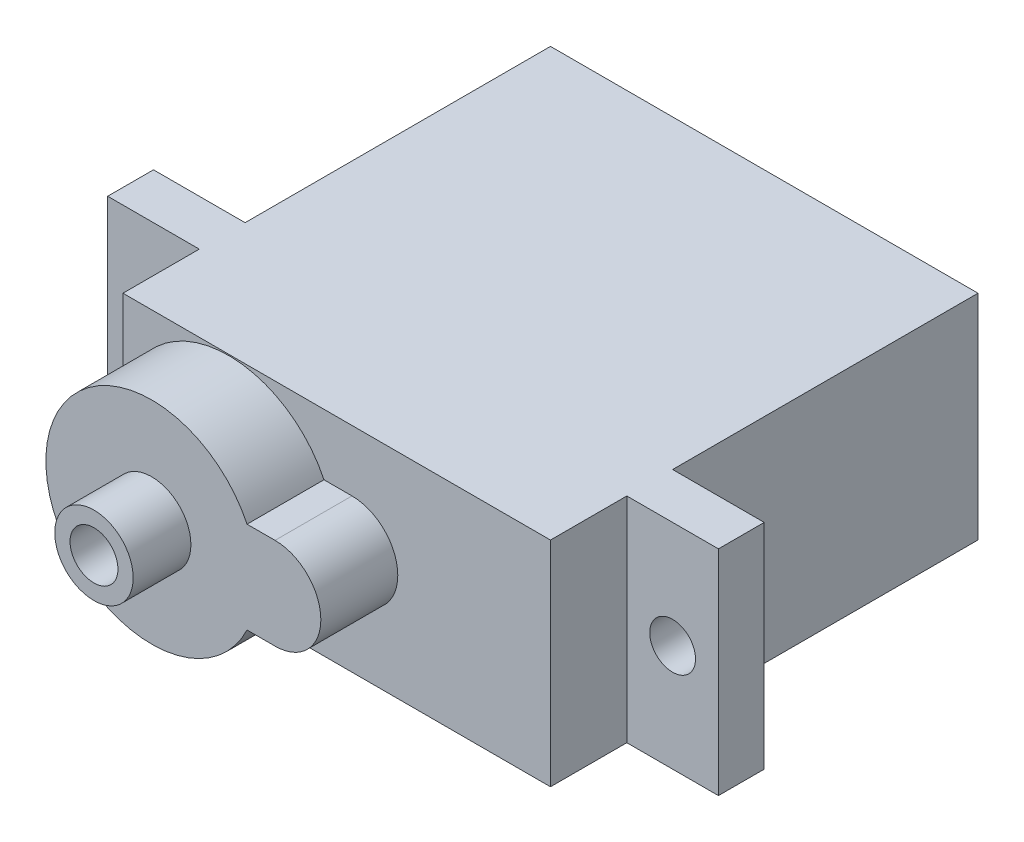
ISO-10303-21;
HEADER;
FILE_DESCRIPTION(('STEP AP214'),'2;1');
FILE_NAME('part.step','',(''),(''),'','','');
FILE_SCHEMA(('AUTOMOTIVE_DESIGN { 1 0 10303 214 1 1 1 1 }'));
ENDSEC;
DATA;
#1=APPLICATION_CONTEXT('core data for automotive mechanical design processes');
#2=APPLICATION_PROTOCOL_DEFINITION('international standard','automotive_design',2000,#1);
#3=PRODUCT_CONTEXT('',#1,'mechanical');
#4=PRODUCT('Part','Part','',(#3));
#5=PRODUCT_RELATED_PRODUCT_CATEGORY('part','',(#4));
#6=PRODUCT_DEFINITION_FORMATION('','',#4);
#7=PRODUCT_DEFINITION_CONTEXT('part definition',#1,'design');
#8=PRODUCT_DEFINITION('design','',#6,#7);
#9=PRODUCT_DEFINITION_SHAPE('','',#8);
#10=(LENGTH_UNIT() NAMED_UNIT(*) SI_UNIT(.MILLI.,.METRE.));
#11=(NAMED_UNIT(*) PLANE_ANGLE_UNIT() SI_UNIT($,.RADIAN.));
#12=(NAMED_UNIT(*) SI_UNIT($,.STERADIAN.) SOLID_ANGLE_UNIT());
#13=UNCERTAINTY_MEASURE_WITH_UNIT(LENGTH_MEASURE(1.E-05),#10,'distance_accuracy_value','');
#14=(GEOMETRIC_REPRESENTATION_CONTEXT(3) GLOBAL_UNCERTAINTY_ASSIGNED_CONTEXT((#13)) GLOBAL_UNIT_ASSIGNED_CONTEXT((#10,
#11,#12)) REPRESENTATION_CONTEXT('',''));
#15=CARTESIAN_POINT('',(0.,0.,0.));
#16=DIRECTION('',(0.,0.,1.));
#17=DIRECTION('',(1.,0.,0.));
#18=AXIS2_PLACEMENT_3D('',#15,#16,#17);
#19=CARTESIAN_POINT('',(0.,0.,26.225));
#20=DIRECTION('',(0.,0.,1.));
#21=DIRECTION('',(1.,0.,0.));
#22=AXIS2_PLACEMENT_3D('',#19,#20,#21);
#23=PLANE('',#22);
#24=DIRECTION('',(-1.,0.,0.));
#25=VECTOR('',#24,1.);
#26=CARTESIAN_POINT('',(0.,-2.38125656149906,26.225));
#27=LINE('',#26,#25);
#28=CARTESIAN_POINT('',(1.01053601839695,-2.38125656149906,26.225));
#29=VERTEX_POINT('',#28);
#30=CARTESIAN_POINT('',(-0.44419736512808,-2.38125656149906,26.225));
#31=VERTEX_POINT('',#30);
#32=EDGE_CURVE('E169',#29,#31,#27,.T.);
#33=ORIENTED_EDGE('',*,*,#32,.F.);
#34=CARTESIAN_POINT('',(1.01053601839692,3.67197356602013E-05,26.225));
#35=DIRECTION('',(0.,0.,1.));
#36=DIRECTION('',(1.,0.,0.));
#37=AXIS2_PLACEMENT_3D('',#34,#35,#36);
#38=CIRCLE('',#37,2.38129328074953);
#39=CARTESIAN_POINT('',(1.010604,2.38133,26.225));
#40=VERTEX_POINT('',#39);
#41=EDGE_CURVE('E176',#29,#40,#38,.T.);
#42=ORIENTED_EDGE('',*,*,#41,.T.);
#43=DIRECTION('',(-1.,0.,0.));
#44=VECTOR('',#43,1.);
#45=CARTESIAN_POINT('',(0.,2.38133,26.225));
#46=LINE('',#45,#44);
#47=CARTESIAN_POINT('',(-0.444232638800502,2.38133,26.225));
#48=VERTEX_POINT('',#47);
#49=EDGE_CURVE('E181',#40,#48,#46,.T.);
#50=ORIENTED_EDGE('',*,*,#49,.T.);
#51=CARTESIAN_POINT('',(-5.40198086063468,0.,26.225));
#52=DIRECTION('',(0.,0.,1.));
#53=DIRECTION('',(1.,0.,0.));
#54=AXIS2_PLACEMENT_3D('',#51,#52,#53);
#55=CIRCLE('',#54,5.5);
#56=CARTESIAN_POINT('',(-10.89565,0.263816957728569,26.225));
#57=VERTEX_POINT('',#56);
#58=EDGE_CURVE('E196',#48,#57,#55,.T.);
#59=ORIENTED_EDGE('',*,*,#58,.T.);
#60=DIRECTION('',(0.,-1.,0.));
#61=VECTOR('',#60,1.);
#62=CARTESIAN_POINT('',(-10.89565,0.,26.225));
#63=LINE('',#62,#61);
#64=CARTESIAN_POINT('',(-10.89565,-0.263816957728569,26.225));
#65=VERTEX_POINT('',#64);
#66=EDGE_CURVE('E198',#57,#65,#63,.T.);
#67=ORIENTED_EDGE('',*,*,#66,.T.);
#68=EDGE_CURVE('E185',#65,#31,#55,.T.);
#69=ORIENTED_EDGE('',*,*,#68,.T.);
#70=EDGE_LOOP('',(#33,#42,#50,#59,#67,#69));
#71=FACE_BOUND('',#70,.T.);
#72=CARTESIAN_POINT('',(-5.40198086063468,0.,26.225));
#73=DIRECTION('',(0.,0.,1.));
#74=DIRECTION('',(1.,0.,0.));
#75=AXIS2_PLACEMENT_3D('',#72,#73,#74);
#76=CIRCLE('',#75,2.0388374802303);
#77=CARTESIAN_POINT('',(-3.36314338040439,0.,26.225));
#78=VERTEX_POINT('',#77);
#79=EDGE_CURVE('E192',#78,#78,#76,.T.);
#80=ORIENTED_EDGE('',*,*,#79,.F.);
#81=EDGE_LOOP('',(#80));
#82=FACE_BOUND('',#81,.T.);
#83=ADVANCED_FACE('F40',(#71,#82),#23,.T.);
#84=CARTESIAN_POINT('',(11.32935,5.555,22.225));
#85=DIRECTION('',(0.,0.,-1.));
#86=DIRECTION('',(-1.,0.,0.));
#87=AXIS2_PLACEMENT_3D('',#84,#85,#86);
#88=PLANE('',#87);
#89=CARTESIAN_POINT('',(-5.40198086063468,0.,22.225));
#90=DIRECTION('',(0.,0.,1.));
#91=DIRECTION('',(1.,0.,0.));
#92=AXIS2_PLACEMENT_3D('',#89,#90,#91);
#93=CIRCLE('',#92,5.5);
#94=CARTESIAN_POINT('',(-10.89565,-0.263816957728569,22.225));
#95=VERTEX_POINT('',#94);
#96=CARTESIAN_POINT('',(-0.44419736512808,-2.38125656149906,22.225));
#97=VERTEX_POINT('',#96);
#98=EDGE_CURVE('E187',#95,#97,#93,.T.);
#99=ORIENTED_EDGE('',*,*,#98,.F.);
#100=DIRECTION('',(0.,-1.,0.));
#101=VECTOR('',#100,1.);
#102=CARTESIAN_POINT('',(-10.89565,5.555,22.225));
#103=LINE('',#102,#101);
#104=CARTESIAN_POINT('',(-10.89565,-5.555,22.225));
#105=VERTEX_POINT('',#104);
#106=EDGE_CURVE('E216',#95,#105,#103,.T.);
#107=ORIENTED_EDGE('',*,*,#106,.T.);
#108=DIRECTION('',(1.,0.,0.));
#109=VECTOR('',#108,1.);
#110=CARTESIAN_POINT('',(11.32935,-5.555,22.225));
#111=LINE('',#110,#109);
#112=CARTESIAN_POINT('',(11.32935,-5.555,22.225));
#113=VERTEX_POINT('',#112);
#114=EDGE_CURVE('E282',#105,#113,#111,.T.);
#115=ORIENTED_EDGE('',*,*,#114,.T.);
#116=DIRECTION('',(0.,-1.,0.));
#117=VECTOR('',#116,1.);
#118=CARTESIAN_POINT('',(11.32935,5.555,22.225));
#119=LINE('',#118,#117);
#120=CARTESIAN_POINT('',(11.32935,5.555,22.225));
#121=VERTEX_POINT('',#120);
#122=EDGE_CURVE('E239',#121,#113,#119,.T.);
#123=ORIENTED_EDGE('',*,*,#122,.F.);
#124=DIRECTION('',(1.,0.,0.));
#125=VECTOR('',#124,1.);
#126=CARTESIAN_POINT('',(11.32935,5.555,22.225));
#127=LINE('',#126,#125);
#128=CARTESIAN_POINT('',(-10.89565,5.555,22.225));
#129=VERTEX_POINT('',#128);
#130=EDGE_CURVE('E340',#129,#121,#127,.T.);
#131=ORIENTED_EDGE('',*,*,#130,.F.);
#132=CARTESIAN_POINT('',(-10.89565,0.263816957728569,22.225));
#133=VERTEX_POINT('',#132);
#134=EDGE_CURVE('E238',#129,#133,#103,.T.);
#135=ORIENTED_EDGE('',*,*,#134,.T.);
#136=CARTESIAN_POINT('',(-0.444232638800502,2.38133,22.225));
#137=VERTEX_POINT('',#136);
#138=EDGE_CURVE('E63',#137,#133,#93,.T.);
#139=ORIENTED_EDGE('',*,*,#138,.F.);
#140=DIRECTION('',(-1.,0.,0.));
#141=VECTOR('',#140,1.);
#142=CARTESIAN_POINT('',(0.,2.38133,22.225));
#143=LINE('',#142,#141);
#144=CARTESIAN_POINT('',(1.010604,2.38133,22.225));
#145=VERTEX_POINT('',#144);
#146=EDGE_CURVE('E204',#145,#137,#143,.T.);
#147=ORIENTED_EDGE('',*,*,#146,.F.);
#148=CARTESIAN_POINT('',(1.01053601839692,3.67197356602013E-05,22.225));
#149=DIRECTION('',(0.,0.,1.));
#150=DIRECTION('',(1.,0.,0.));
#151=AXIS2_PLACEMENT_3D('',#148,#149,#150);
#152=CIRCLE('',#151,2.38129328074953);
#153=CARTESIAN_POINT('',(1.01053601839695,-2.38125656149906,22.225));
#154=VERTEX_POINT('',#153);
#155=EDGE_CURVE('E201',#154,#145,#152,.T.);
#156=ORIENTED_EDGE('',*,*,#155,.F.);
#157=DIRECTION('',(-1.,0.,0.));
#158=VECTOR('',#157,1.);
#159=CARTESIAN_POINT('',(0.,-2.38125656149906,22.225));
#160=LINE('',#159,#158);
#161=EDGE_CURVE('E56',#154,#97,#160,.T.);
#162=ORIENTED_EDGE('',*,*,#161,.T.);
#163=EDGE_LOOP('',(#99,#107,#115,#123,#131,#135,#139,#147,#156,#162));
#164=FACE_BOUND('',#163,.T.);
#165=ADVANCED_FACE('F229',(#164),#88,.F.);
#166=CARTESIAN_POINT('',(11.32935,5.555,0.));
#167=DIRECTION('',(-1.,0.,0.));
#168=DIRECTION('',(0.,0.,1.));
#169=AXIS2_PLACEMENT_3D('',#166,#167,#168);
#170=PLANE('',#169);
#171=DIRECTION('',(0.,0.,-1.));
#172=VECTOR('',#171,1.);
#173=CARTESIAN_POINT('',(11.32935,-5.555,0.));
#174=LINE('',#173,#172);
#175=CARTESIAN_POINT('',(11.32935,-5.555,15.875));
#176=VERTEX_POINT('',#175);
#177=CARTESIAN_POINT('',(11.32935,-5.555,0.));
#178=VERTEX_POINT('',#177);
#179=EDGE_CURVE('E172',#176,#178,#174,.T.);
#180=ORIENTED_EDGE('',*,*,#179,.T.);
#181=DIRECTION('',(0.,-1.,0.));
#182=VECTOR('',#181,1.);
#183=CARTESIAN_POINT('',(11.32935,5.555,0.));
#184=LINE('',#183,#182);
#185=CARTESIAN_POINT('',(11.32935,5.555,0.));
#186=VERTEX_POINT('',#185);
#187=EDGE_CURVE('E49',#186,#178,#184,.T.);
#188=ORIENTED_EDGE('',*,*,#187,.F.);
#189=DIRECTION('',(0.,0.,-1.));
#190=VECTOR('',#189,1.);
#191=CARTESIAN_POINT('',(11.32935,5.555,0.));
#192=LINE('',#191,#190);
#193=CARTESIAN_POINT('',(11.32935,5.555,15.875));
#194=VERTEX_POINT('',#193);
#195=EDGE_CURVE('E297',#194,#186,#192,.T.);
#196=ORIENTED_EDGE('',*,*,#195,.F.);
#197=DIRECTION('',(0.,-1.,0.));
#198=VECTOR('',#197,1.);
#199=CARTESIAN_POINT('',(11.32935,5.555,15.875));
#200=LINE('',#199,#198);
#201=EDGE_CURVE('E298',#194,#176,#200,.T.);
#202=ORIENTED_EDGE('',*,*,#201,.T.);
#203=EDGE_LOOP('',(#180,#188,#196,#202));
#204=FACE_BOUND('',#203,.T.);
#205=ADVANCED_FACE('F42',(#204),#170,.F.);
#206=CARTESIAN_POINT('',(-10.89565,5.555,0.));
#207=DIRECTION('',(0.,0.,1.));
#208=DIRECTION('',(1.,0.,0.));
#209=AXIS2_PLACEMENT_3D('',#206,#207,#208);
#210=PLANE('',#209);
#211=DIRECTION('',(-1.,0.,0.));
#212=VECTOR('',#211,1.);
#213=CARTESIAN_POINT('',(-10.89565,-5.555,0.));
#214=LINE('',#213,#212);
#215=CARTESIAN_POINT('',(-10.89565,-5.555,0.));
#216=VERTEX_POINT('',#215);
#217=EDGE_CURVE('E349',#178,#216,#214,.T.);
#218=ORIENTED_EDGE('',*,*,#217,.T.);
#219=DIRECTION('',(0.,-1.,0.));
#220=VECTOR('',#219,1.);
#221=CARTESIAN_POINT('',(-10.89565,5.555,0.));
#222=LINE('',#221,#220);
#223=CARTESIAN_POINT('',(-10.89565,5.555,0.));
#224=VERTEX_POINT('',#223);
#225=EDGE_CURVE('E259',#224,#216,#222,.T.);
#226=ORIENTED_EDGE('',*,*,#225,.F.);
#227=DIRECTION('',(-1.,0.,0.));
#228=VECTOR('',#227,1.);
#229=CARTESIAN_POINT('',(-10.89565,5.555,0.));
#230=LINE('',#229,#228);
#231=EDGE_CURVE('E326',#186,#224,#230,.T.);
#232=ORIENTED_EDGE('',*,*,#231,.F.);
#233=ORIENTED_EDGE('',*,*,#187,.T.);
#234=EDGE_LOOP('',(#218,#226,#232,#233));
#235=FACE_BOUND('',#234,.T.);
#236=ADVANCED_FACE('F369',(#235),#210,.F.);
#237=CARTESIAN_POINT('',(-10.89565,5.555,15.875));
#238=DIRECTION('',(1.,0.,0.));
#239=DIRECTION('',(0.,0.,-1.));
#240=AXIS2_PLACEMENT_3D('',#237,#238,#239);
#241=PLANE('',#240);
#242=DIRECTION('',(0.,0.,1.));
#243=VECTOR('',#242,1.);
#244=CARTESIAN_POINT('',(-10.89565,-5.555,15.875));
#245=LINE('',#244,#243);
#246=CARTESIAN_POINT('',(-10.89565,-5.555,15.875));
#247=VERTEX_POINT('',#246);
#248=EDGE_CURVE('E351',#216,#247,#245,.T.);
#249=ORIENTED_EDGE('',*,*,#248,.T.);
#250=DIRECTION('',(0.,-1.,0.));
#251=VECTOR('',#250,1.);
#252=CARTESIAN_POINT('',(-10.89565,5.555,15.875));
#253=LINE('',#252,#251);
#254=CARTESIAN_POINT('',(-10.89565,5.555,15.875));
#255=VERTEX_POINT('',#254);
#256=EDGE_CURVE('E262',#255,#247,#253,.T.);
#257=ORIENTED_EDGE('',*,*,#256,.F.);
#258=DIRECTION('',(0.,0.,1.));
#259=VECTOR('',#258,1.);
#260=CARTESIAN_POINT('',(-10.89565,5.555,15.875));
#261=LINE('',#260,#259);
#262=EDGE_CURVE('E328',#224,#255,#261,.T.);
#263=ORIENTED_EDGE('',*,*,#262,.F.);
#264=ORIENTED_EDGE('',*,*,#225,.T.);
#265=EDGE_LOOP('',(#249,#257,#263,#264));
#266=FACE_BOUND('',#265,.T.);
#267=ADVANCED_FACE('F366',(#266),#241,.F.);
#268=CARTESIAN_POINT('',(-15.65815,5.555,15.875));
#269=DIRECTION('',(0.,0.,1.));
#270=DIRECTION('',(1.,0.,0.));
#271=AXIS2_PLACEMENT_3D('',#268,#269,#270);
#272=PLANE('',#271);
#273=CARTESIAN_POINT('',(-13.2769375519628,5.85583144663195E-05,15.875));
#274=DIRECTION('',(0.,0.,1.));
#275=DIRECTION('',(1.,0.,0.));
#276=AXIS2_PLACEMENT_3D('',#273,#274,#275);
#277=CIRCLE('',#276,1.19060291253007);
#278=CARTESIAN_POINT('',(-12.0863346394327,5.85583144663195E-05,15.875));
#279=VERTEX_POINT('',#278);
#280=EDGE_CURVE('E427',#279,#279,#277,.T.);
#281=ORIENTED_EDGE('',*,*,#280,.T.);
#282=EDGE_LOOP('',(#281));
#283=FACE_BOUND('',#282,.T.);
#284=DIRECTION('',(-1.,0.,0.));
#285=VECTOR('',#284,1.);
#286=CARTESIAN_POINT('',(-15.65815,-5.555,15.875));
#287=LINE('',#286,#285);
#288=CARTESIAN_POINT('',(-15.65815,-5.555,15.875));
#289=VERTEX_POINT('',#288);
#290=EDGE_CURVE('E353',#247,#289,#287,.T.);
#291=ORIENTED_EDGE('',*,*,#290,.T.);
#292=DIRECTION('',(0.,-1.,0.));
#293=VECTOR('',#292,1.);
#294=CARTESIAN_POINT('',(-15.65815,5.555,15.875));
#295=LINE('',#294,#293);
#296=CARTESIAN_POINT('',(-15.65815,5.555,15.875));
#297=VERTEX_POINT('',#296);
#298=EDGE_CURVE('E265',#297,#289,#295,.T.);
#299=ORIENTED_EDGE('',*,*,#298,.F.);
#300=DIRECTION('',(-1.,0.,0.));
#301=VECTOR('',#300,1.);
#302=CARTESIAN_POINT('',(-15.65815,5.555,15.875));
#303=LINE('',#302,#301);
#304=EDGE_CURVE('E333',#255,#297,#303,.T.);
#305=ORIENTED_EDGE('',*,*,#304,.F.);
#306=ORIENTED_EDGE('',*,*,#256,.T.);
#307=EDGE_LOOP('',(#291,#299,#305,#306));
#308=FACE_BOUND('',#307,.T.);
#309=ADVANCED_FACE('F361',(#283,#308),#272,.F.);
#310=CARTESIAN_POINT('',(-15.65815,5.555,18.25625));
#311=DIRECTION('',(1.,0.,0.));
#312=DIRECTION('',(0.,0.,-1.));
#313=AXIS2_PLACEMENT_3D('',#310,#311,#312);
#314=PLANE('',#313);
#315=DIRECTION('',(0.,0.,1.));
#316=VECTOR('',#315,1.);
#317=CARTESIAN_POINT('',(-15.65815,-5.555,18.25625));
#318=LINE('',#317,#316);
#319=CARTESIAN_POINT('',(-15.65815,-5.555,18.25625));
#320=VERTEX_POINT('',#319);
#321=EDGE_CURVE('E286',#289,#320,#318,.T.);
#322=ORIENTED_EDGE('',*,*,#321,.T.);
#323=DIRECTION('',(0.,-1.,0.));
#324=VECTOR('',#323,1.);
#325=CARTESIAN_POINT('',(-15.65815,5.555,18.25625));
#326=LINE('',#325,#324);
#327=CARTESIAN_POINT('',(-15.65815,5.555,18.25625));
#328=VERTEX_POINT('',#327);
#329=EDGE_CURVE('E267',#328,#320,#326,.T.);
#330=ORIENTED_EDGE('',*,*,#329,.F.);
#331=DIRECTION('',(0.,0.,1.));
#332=VECTOR('',#331,1.);
#333=CARTESIAN_POINT('',(-15.65815,5.555,18.25625));
#334=LINE('',#333,#332);
#335=EDGE_CURVE('E335',#297,#328,#334,.T.);
#336=ORIENTED_EDGE('',*,*,#335,.F.);
#337=ORIENTED_EDGE('',*,*,#298,.T.);
#338=EDGE_LOOP('',(#322,#330,#336,#337));
#339=FACE_BOUND('',#338,.T.);
#340=ADVANCED_FACE('F355',(#339),#314,.F.);
#341=CARTESIAN_POINT('',(-10.89565,5.555,18.25625));
#342=DIRECTION('',(0.,0.,-1.));
#343=DIRECTION('',(-1.,0.,0.));
#344=AXIS2_PLACEMENT_3D('',#341,#342,#343);
#345=PLANE('',#344);
#346=CARTESIAN_POINT('',(-13.2769375519628,5.85583144663195E-05,18.25625));
#347=DIRECTION('',(0.,0.,1.));
#348=DIRECTION('',(1.,0.,0.));
#349=AXIS2_PLACEMENT_3D('',#346,#347,#348);
#350=CIRCLE('',#349,1.19060291253007);
#351=CARTESIAN_POINT('',(-12.0863346394327,5.85583144663195E-05,18.25625));
#352=VERTEX_POINT('',#351);
#353=EDGE_CURVE('E431',#352,#352,#350,.T.);
#354=ORIENTED_EDGE('',*,*,#353,.F.);
#355=EDGE_LOOP('',(#354));
#356=FACE_BOUND('',#355,.T.);
#357=DIRECTION('',(1.,0.,0.));
#358=VECTOR('',#357,1.);
#359=CARTESIAN_POINT('',(-10.89565,-5.555,18.25625));
#360=LINE('',#359,#358);
#361=CARTESIAN_POINT('',(-10.89565,-5.555,18.25625));
#362=VERTEX_POINT('',#361);
#363=EDGE_CURVE('E281',#320,#362,#360,.T.);
#364=ORIENTED_EDGE('',*,*,#363,.T.);
#365=DIRECTION('',(0.,-1.,0.));
#366=VECTOR('',#365,1.);
#367=CARTESIAN_POINT('',(-10.89565,5.555,18.25625));
#368=LINE('',#367,#366);
#369=CARTESIAN_POINT('',(-10.89565,5.555,18.25625));
#370=VERTEX_POINT('',#369);
#371=EDGE_CURVE('E240',#370,#362,#368,.T.);
#372=ORIENTED_EDGE('',*,*,#371,.F.);
#373=DIRECTION('',(1.,0.,0.));
#374=VECTOR('',#373,1.);
#375=CARTESIAN_POINT('',(-10.89565,5.555,18.25625));
#376=LINE('',#375,#374);
#377=EDGE_CURVE('E337',#328,#370,#376,.T.);
#378=ORIENTED_EDGE('',*,*,#377,.F.);
#379=ORIENTED_EDGE('',*,*,#329,.T.);
#380=EDGE_LOOP('',(#364,#372,#378,#379));
#381=FACE_BOUND('',#380,.T.);
#382=ADVANCED_FACE('F371',(#356,#381),#345,.F.);
#383=CARTESIAN_POINT('',(-10.89565,5.555,22.225));
#384=DIRECTION('',(1.,0.,0.));
#385=DIRECTION('',(0.,0.,-1.));
#386=AXIS2_PLACEMENT_3D('',#383,#384,#385);
#387=PLANE('',#386);
#388=DIRECTION('',(0.,0.,1.));
#389=VECTOR('',#388,1.);
#390=CARTESIAN_POINT('',(-10.89565,-5.555,22.225));
#391=LINE('',#390,#389);
#392=EDGE_CURVE('E236',#362,#105,#391,.T.);
#393=ORIENTED_EDGE('',*,*,#392,.T.);
#394=ORIENTED_EDGE('',*,*,#106,.F.);
#395=DIRECTION('',(0.,0.,-1.));
#396=VECTOR('',#395,1.);
#397=CARTESIAN_POINT('',(-10.89565,-0.263816957728569,26.225));
#398=LINE('',#397,#396);
#399=EDGE_CURVE('E219',#65,#95,#398,.T.);
#400=ORIENTED_EDGE('',*,*,#399,.F.);
#401=ORIENTED_EDGE('',*,*,#66,.F.);
#402=DIRECTION('',(0.,0.,-1.));
#403=VECTOR('',#402,1.);
#404=CARTESIAN_POINT('',(-10.89565,0.263816957728569,26.225));
#405=LINE('',#404,#403);
#406=EDGE_CURVE('E221',#57,#133,#405,.T.);
#407=ORIENTED_EDGE('',*,*,#406,.T.);
#408=ORIENTED_EDGE('',*,*,#134,.F.);
#409=DIRECTION('',(0.,0.,1.));
#410=VECTOR('',#409,1.);
#411=CARTESIAN_POINT('',(-10.89565,5.555,22.225));
#412=LINE('',#411,#410);
#413=EDGE_CURVE('E276',#370,#129,#412,.T.);
#414=ORIENTED_EDGE('',*,*,#413,.F.);
#415=ORIENTED_EDGE('',*,*,#371,.T.);
#416=EDGE_LOOP('',(#393,#394,#400,#401,#407,#408,#414,#415));
#417=FACE_BOUND('',#416,.T.);
#418=ADVANCED_FACE('F232',(#417),#387,.F.);
#419=CARTESIAN_POINT('',(11.32935,5.555,18.25625));
#420=DIRECTION('',(-1.,0.,0.));
#421=DIRECTION('',(0.,0.,1.));
#422=AXIS2_PLACEMENT_3D('',#419,#420,#421);
#423=PLANE('',#422);
#424=DIRECTION('',(0.,0.,-1.));
#425=VECTOR('',#424,1.);
#426=CARTESIAN_POINT('',(11.32935,-5.555,18.25625));
#427=LINE('',#426,#425);
#428=CARTESIAN_POINT('',(11.32935,-5.555,18.25625));
#429=VERTEX_POINT('',#428);
#430=EDGE_CURVE('E284',#113,#429,#427,.T.);
#431=ORIENTED_EDGE('',*,*,#430,.T.);
#432=DIRECTION('',(0.,-1.,0.));
#433=VECTOR('',#432,1.);
#434=CARTESIAN_POINT('',(11.32935,5.555,18.25625));
#435=LINE('',#434,#433);
#436=CARTESIAN_POINT('',(11.32935,5.555,18.25625));
#437=VERTEX_POINT('',#436);
#438=EDGE_CURVE('E242',#437,#429,#435,.T.);
#439=ORIENTED_EDGE('',*,*,#438,.F.);
#440=DIRECTION('',(0.,0.,-1.));
#441=VECTOR('',#440,1.);
#442=CARTESIAN_POINT('',(11.32935,5.555,18.25625));
#443=LINE('',#442,#441);
#444=EDGE_CURVE('E342',#121,#437,#443,.T.);
#445=ORIENTED_EDGE('',*,*,#444,.F.);
#446=ORIENTED_EDGE('',*,*,#122,.T.);
#447=EDGE_LOOP('',(#431,#439,#445,#446));
#448=FACE_BOUND('',#447,.T.);
#449=ADVANCED_FACE('F379',(#448),#423,.F.);
#450=CARTESIAN_POINT('',(16.09185,5.555,18.25625));
#451=DIRECTION('',(0.,0.,-1.));
#452=DIRECTION('',(-1.,0.,0.));
#453=AXIS2_PLACEMENT_3D('',#450,#451,#452);
#454=PLANE('',#453);
#455=CARTESIAN_POINT('',(13.7105365803843,6.14151503597256E-05,18.25625));
#456=DIRECTION('',(0.,0.,1.));
#457=DIRECTION('',(1.,0.,0.));
#458=AXIS2_PLACEMENT_3D('',#455,#456,#457);
#459=CIRCLE('',#458,1.1906024302544);
#460=CARTESIAN_POINT('',(14.9011390106387,6.14151503597256E-05,18.25625));
#461=VERTEX_POINT('',#460);
#462=EDGE_CURVE('E436',#461,#461,#459,.T.);
#463=ORIENTED_EDGE('',*,*,#462,.F.);
#464=EDGE_LOOP('',(#463));
#465=FACE_BOUND('',#464,.T.);
#466=DIRECTION('',(1.,0.,0.));
#467=VECTOR('',#466,1.);
#468=CARTESIAN_POINT('',(16.09185,-5.555,18.25625));
#469=LINE('',#468,#467);
#470=CARTESIAN_POINT('',(16.09185,-5.555,18.25625));
#471=VERTEX_POINT('',#470);
#472=EDGE_CURVE('E291',#429,#471,#469,.T.);
#473=ORIENTED_EDGE('',*,*,#472,.T.);
#474=DIRECTION('',(0.,-1.,0.));
#475=VECTOR('',#474,1.);
#476=CARTESIAN_POINT('',(16.09185,5.555,18.25625));
#477=LINE('',#476,#475);
#478=CARTESIAN_POINT('',(16.09185,5.555,18.25625));
#479=VERTEX_POINT('',#478);
#480=EDGE_CURVE('E249',#479,#471,#477,.T.);
#481=ORIENTED_EDGE('',*,*,#480,.F.);
#482=DIRECTION('',(1.,0.,0.));
#483=VECTOR('',#482,1.);
#484=CARTESIAN_POINT('',(16.09185,5.555,18.25625));
#485=LINE('',#484,#483);
#486=EDGE_CURVE('E344',#437,#479,#485,.T.);
#487=ORIENTED_EDGE('',*,*,#486,.F.);
#488=ORIENTED_EDGE('',*,*,#438,.T.);
#489=EDGE_LOOP('',(#473,#481,#487,#488));
#490=FACE_BOUND('',#489,.T.);
#491=ADVANCED_FACE('F469',(#465,#490),#454,.F.);
#492=CARTESIAN_POINT('',(16.09185,5.555,15.875));
#493=DIRECTION('',(-1.,0.,0.));
#494=DIRECTION('',(0.,0.,1.));
#495=AXIS2_PLACEMENT_3D('',#492,#493,#494);
#496=PLANE('',#495);
#497=DIRECTION('',(0.,0.,-1.));
#498=VECTOR('',#497,1.);
#499=CARTESIAN_POINT('',(16.09185,-5.555,15.875));
#500=LINE('',#499,#498);
#501=CARTESIAN_POINT('',(16.09185,-5.555,15.875));
#502=VERTEX_POINT('',#501);
#503=EDGE_CURVE('E293',#471,#502,#500,.T.);
#504=ORIENTED_EDGE('',*,*,#503,.T.);
#505=DIRECTION('',(0.,-1.,0.));
#506=VECTOR('',#505,1.);
#507=CARTESIAN_POINT('',(16.09185,5.555,15.875));
#508=LINE('',#507,#506);
#509=CARTESIAN_POINT('',(16.09185,5.555,15.875));
#510=VERTEX_POINT('',#509);
#511=EDGE_CURVE('E301',#510,#502,#508,.T.);
#512=ORIENTED_EDGE('',*,*,#511,.F.);
#513=DIRECTION('',(0.,0.,-1.));
#514=VECTOR('',#513,1.);
#515=CARTESIAN_POINT('',(16.09185,5.555,15.875));
#516=LINE('',#515,#514);
#517=EDGE_CURVE('E311',#479,#510,#516,.T.);
#518=ORIENTED_EDGE('',*,*,#517,.F.);
#519=ORIENTED_EDGE('',*,*,#480,.T.);
#520=EDGE_LOOP('',(#504,#512,#518,#519));
#521=FACE_BOUND('',#520,.T.);
#522=ADVANCED_FACE('F309',(#521),#496,.F.);
#523=CARTESIAN_POINT('',(11.32935,5.555,15.875));
#524=DIRECTION('',(0.,0.,1.));
#525=DIRECTION('',(1.,0.,0.));
#526=AXIS2_PLACEMENT_3D('',#523,#524,#525);
#527=PLANE('',#526);
#528=CARTESIAN_POINT('',(13.7105365803843,6.14151503597256E-05,15.875));
#529=DIRECTION('',(0.,0.,1.));
#530=DIRECTION('',(1.,0.,0.));
#531=AXIS2_PLACEMENT_3D('',#528,#529,#530);
#532=CIRCLE('',#531,1.1906024302544);
#533=CARTESIAN_POINT('',(14.9011390106387,6.14151503597256E-05,15.875));
#534=VERTEX_POINT('',#533);
#535=EDGE_CURVE('E44',#534,#534,#532,.T.);
#536=ORIENTED_EDGE('',*,*,#535,.T.);
#537=EDGE_LOOP('',(#536));
#538=FACE_BOUND('',#537,.T.);
#539=DIRECTION('',(-1.,0.,0.));
#540=VECTOR('',#539,1.);
#541=CARTESIAN_POINT('',(11.32935,-5.555,15.875));
#542=LINE('',#541,#540);
#543=EDGE_CURVE('E295',#502,#176,#542,.T.);
#544=ORIENTED_EDGE('',*,*,#543,.T.);
#545=ORIENTED_EDGE('',*,*,#201,.F.);
#546=DIRECTION('',(-1.,0.,0.));
#547=VECTOR('',#546,1.);
#548=CARTESIAN_POINT('',(11.32935,5.555,15.875));
#549=LINE('',#548,#547);
#550=EDGE_CURVE('E302',#510,#194,#549,.T.);
#551=ORIENTED_EDGE('',*,*,#550,.F.);
#552=ORIENTED_EDGE('',*,*,#511,.T.);
#553=EDGE_LOOP('',(#544,#545,#551,#552));
#554=FACE_BOUND('',#553,.T.);
#555=ADVANCED_FACE('F319',(#538,#554),#527,.F.);
#556=CARTESIAN_POINT('',(0.,5.555,0.));
#557=DIRECTION('',(0.,1.,0.));
#558=DIRECTION('',(0.,0.,1.));
#559=AXIS2_PLACEMENT_3D('',#556,#557,#558);
#560=PLANE('',#559);
#561=ORIENTED_EDGE('',*,*,#195,.T.);
#562=ORIENTED_EDGE('',*,*,#231,.T.);
#563=ORIENTED_EDGE('',*,*,#262,.T.);
#564=ORIENTED_EDGE('',*,*,#304,.T.);
#565=ORIENTED_EDGE('',*,*,#335,.T.);
#566=ORIENTED_EDGE('',*,*,#377,.T.);
#567=ORIENTED_EDGE('',*,*,#413,.T.);
#568=ORIENTED_EDGE('',*,*,#130,.T.);
#569=ORIENTED_EDGE('',*,*,#444,.T.);
#570=ORIENTED_EDGE('',*,*,#486,.T.);
#571=ORIENTED_EDGE('',*,*,#517,.T.);
#572=ORIENTED_EDGE('',*,*,#550,.T.);
#573=EDGE_LOOP('',(#561,#562,#563,#564,#565,#566,#567,#568,#569,#570,#571,#572));
#574=FACE_BOUND('',#573,.T.);
#575=ADVANCED_FACE('F370',(#574),#560,.T.);
#576=CARTESIAN_POINT('',(0.,-5.555,0.));
#577=DIRECTION('',(0.,1.,0.));
#578=DIRECTION('',(0.,0.,1.));
#579=AXIS2_PLACEMENT_3D('',#576,#577,#578);
#580=PLANE('',#579);
#581=ORIENTED_EDGE('',*,*,#179,.F.);
#582=ORIENTED_EDGE('',*,*,#543,.F.);
#583=ORIENTED_EDGE('',*,*,#503,.F.);
#584=ORIENTED_EDGE('',*,*,#472,.F.);
#585=ORIENTED_EDGE('',*,*,#430,.F.);
#586=ORIENTED_EDGE('',*,*,#114,.F.);
#587=ORIENTED_EDGE('',*,*,#392,.F.);
#588=ORIENTED_EDGE('',*,*,#363,.F.);
#589=ORIENTED_EDGE('',*,*,#321,.F.);
#590=ORIENTED_EDGE('',*,*,#290,.F.);
#591=ORIENTED_EDGE('',*,*,#248,.F.);
#592=ORIENTED_EDGE('',*,*,#217,.F.);
#593=EDGE_LOOP('',(#581,#582,#583,#584,#585,#586,#587,#588,#589,#590,#591,#592));
#594=FACE_BOUND('',#593,.T.);
#595=ADVANCED_FACE('F279',(#594),#580,.F.);
#596=CARTESIAN_POINT('',(0.,-2.38125656149906,26.225));
#597=DIRECTION('',(0.,-1.,0.));
#598=DIRECTION('',(0.,0.,-1.));
#599=AXIS2_PLACEMENT_3D('',#596,#597,#598);
#600=PLANE('',#599);
#601=ORIENTED_EDGE('',*,*,#161,.F.);
#602=DIRECTION('',(0.,0.,-1.));
#603=VECTOR('',#602,1.);
#604=CARTESIAN_POINT('',(1.01053601839695,-2.38125656149906,26.225));
#605=LINE('',#604,#603);
#606=EDGE_CURVE('E165',#29,#154,#605,.T.);
#607=ORIENTED_EDGE('',*,*,#606,.F.);
#608=ORIENTED_EDGE('',*,*,#32,.T.);
#609=DIRECTION('',(0.,0.,-1.));
#610=VECTOR('',#609,1.);
#611=CARTESIAN_POINT('',(-0.44419736512808,-2.38125656149906,26.225));
#612=LINE('',#611,#610);
#613=EDGE_CURVE('E208',#31,#97,#612,.T.);
#614=ORIENTED_EDGE('',*,*,#613,.T.);
#615=EDGE_LOOP('',(#601,#607,#608,#614));
#616=FACE_BOUND('',#615,.T.);
#617=ADVANCED_FACE('F167',(#616),#600,.T.);
#618=CARTESIAN_POINT('',(1.01053601839692,3.67197356602013E-05,26.225));
#619=DIRECTION('',(0.,0.,-1.));
#620=DIRECTION('',(-1.,0.,0.));
#621=AXIS2_PLACEMENT_3D('',#618,#619,#620);
#622=CYLINDRICAL_SURFACE('',#621,2.38129328074953);
#623=ORIENTED_EDGE('',*,*,#155,.T.);
#624=DIRECTION('',(0.,0.,-1.));
#625=VECTOR('',#624,1.);
#626=CARTESIAN_POINT('',(1.010604,2.38133,26.225));
#627=LINE('',#626,#625);
#628=EDGE_CURVE('E173',#40,#145,#627,.T.);
#629=ORIENTED_EDGE('',*,*,#628,.F.);
#630=ORIENTED_EDGE('',*,*,#41,.F.);
#631=ORIENTED_EDGE('',*,*,#606,.T.);
#632=EDGE_LOOP('',(#623,#629,#630,#631));
#633=FACE_BOUND('',#632,.T.);
#634=ADVANCED_FACE('F177',(#633),#622,.T.);
#635=CARTESIAN_POINT('',(0.,2.38133,26.225));
#636=DIRECTION('',(0.,-1.,0.));
#637=DIRECTION('',(0.,0.,-1.));
#638=AXIS2_PLACEMENT_3D('',#635,#636,#637);
#639=PLANE('',#638);
#640=ORIENTED_EDGE('',*,*,#146,.T.);
#641=DIRECTION('',(0.,0.,-1.));
#642=VECTOR('',#641,1.);
#643=CARTESIAN_POINT('',(-0.444232638800502,2.38133,26.225));
#644=LINE('',#643,#642);
#645=EDGE_CURVE('E226',#48,#137,#644,.T.);
#646=ORIENTED_EDGE('',*,*,#645,.F.);
#647=ORIENTED_EDGE('',*,*,#49,.F.);
#648=ORIENTED_EDGE('',*,*,#628,.T.);
#649=EDGE_LOOP('',(#640,#646,#647,#648));
#650=FACE_BOUND('',#649,.T.);
#651=ADVANCED_FACE('F529',(#650),#639,.F.);
#652=CARTESIAN_POINT('',(-5.40198086063468,0.,26.225));
#653=DIRECTION('',(0.,0.,-1.));
#654=DIRECTION('',(-1.,0.,0.));
#655=AXIS2_PLACEMENT_3D('',#652,#653,#654);
#656=CYLINDRICAL_SURFACE('',#655,5.5);
#657=ORIENTED_EDGE('',*,*,#138,.T.);
#658=ORIENTED_EDGE('',*,*,#406,.F.);
#659=ORIENTED_EDGE('',*,*,#58,.F.);
#660=ORIENTED_EDGE('',*,*,#645,.T.);
#661=EDGE_LOOP('',(#657,#658,#659,#660));
#662=FACE_BOUND('',#661,.T.);
#663=ADVANCED_FACE('F421',(#662),#656,.T.);
#664=ORIENTED_EDGE('',*,*,#98,.T.);
#665=ORIENTED_EDGE('',*,*,#613,.F.);
#666=ORIENTED_EDGE('',*,*,#68,.F.);
#667=ORIENTED_EDGE('',*,*,#399,.T.);
#668=EDGE_LOOP('',(#664,#665,#666,#667));
#669=FACE_BOUND('',#668,.T.);
#670=ADVANCED_FACE('F227',(#669),#656,.T.);
#671=CARTESIAN_POINT('',(-5.40198086063468,0.,29.225));
#672=DIRECTION('',(0.,0.,1.));
#673=DIRECTION('',(1.,0.,0.));
#674=AXIS2_PLACEMENT_3D('',#671,#672,#673);
#675=PLANE('',#674);
#676=CARTESIAN_POINT('',(-5.40198086063468,0.,29.225));
#677=DIRECTION('',(0.,0.,1.));
#678=DIRECTION('',(1.,0.,0.));
#679=AXIS2_PLACEMENT_3D('',#676,#677,#678);
#680=CIRCLE('',#679,2.0388374802303);
#681=CARTESIAN_POINT('',(-3.36314338040439,0.,29.225));
#682=VERTEX_POINT('',#681);
#683=EDGE_CURVE('E202',#682,#682,#680,.T.);
#684=ORIENTED_EDGE('',*,*,#683,.T.);
#685=EDGE_LOOP('',(#684));
#686=FACE_BOUND('',#685,.T.);
#687=CARTESIAN_POINT('',(-5.40198086063468,0.,29.225));
#688=DIRECTION('',(0.,0.,1.));
#689=DIRECTION('',(1.,0.,0.));
#690=AXIS2_PLACEMENT_3D('',#687,#688,#689);
#691=CIRCLE('',#690,1.24519559043406);
#692=CARTESIAN_POINT('',(-4.15678527020062,0.,29.225));
#693=VERTEX_POINT('',#692);
#694=EDGE_CURVE('E426',#693,#693,#691,.T.);
#695=ORIENTED_EDGE('',*,*,#694,.F.);
#696=EDGE_LOOP('',(#695));
#697=FACE_BOUND('',#696,.T.);
#698=ADVANCED_FACE('F411',(#686,#697),#675,.T.);
#699=CARTESIAN_POINT('',(-5.40198086063468,0.,29.225));
#700=DIRECTION('',(0.,0.,-1.));
#701=DIRECTION('',(-1.,0.,0.));
#702=AXIS2_PLACEMENT_3D('',#699,#700,#701);
#703=CYLINDRICAL_SURFACE('',#702,2.0388374802303);
#704=ORIENTED_EDGE('',*,*,#683,.F.);
#705=EDGE_LOOP('',(#704));
#706=FACE_BOUND('',#705,.T.);
#707=ORIENTED_EDGE('',*,*,#79,.T.);
#708=EDGE_LOOP('',(#707));
#709=FACE_BOUND('',#708,.T.);
#710=ADVANCED_FACE('F403',(#706,#709),#703,.T.);
#711=CARTESIAN_POINT('',(-5.40198086063468,0.,29.225));
#712=DIRECTION('',(0.,0.,-1.));
#713=DIRECTION('',(-1.,0.,0.));
#714=AXIS2_PLACEMENT_3D('',#711,#712,#713);
#715=CYLINDRICAL_SURFACE('',#714,1.24519559043406);
#716=ORIENTED_EDGE('',*,*,#694,.T.);
#717=EDGE_LOOP('',(#716));
#718=FACE_BOUND('',#717,.T.);
#719=CARTESIAN_POINT('',(-5.40198086063468,0.,26.225));
#720=DIRECTION('',(0.,0.,1.));
#721=DIRECTION('',(1.,0.,0.));
#722=AXIS2_PLACEMENT_3D('',#719,#720,#721);
#723=CIRCLE('',#722,1.24519559043406);
#724=CARTESIAN_POINT('',(-4.15678527020062,0.,26.225));
#725=VERTEX_POINT('',#724);
#726=EDGE_CURVE('E11',#725,#725,#723,.F.);
#727=ORIENTED_EDGE('',*,*,#726,.T.);
#728=EDGE_LOOP('',(#727));
#729=FACE_BOUND('',#728,.T.);
#730=ADVANCED_FACE('F394',(#718,#729),#715,.F.);
#731=ORIENTED_EDGE('',*,*,#726,.F.);
#732=EDGE_LOOP('',(#731));
#733=FACE_BOUND('',#732,.T.);
#734=ADVANCED_FACE('F385',(#733),#23,.T.);
#735=CARTESIAN_POINT('',(-13.2769375519628,5.85583144663195E-05,-4.74375));
#736=DIRECTION('',(0.,0.,1.));
#737=DIRECTION('',(1.,0.,0.));
#738=AXIS2_PLACEMENT_3D('',#735,#736,#737);
#739=CYLINDRICAL_SURFACE('',#738,1.19060291253007);
#740=ORIENTED_EDGE('',*,*,#353,.T.);
#741=EDGE_LOOP('',(#740));
#742=FACE_BOUND('',#741,.T.);
#743=ORIENTED_EDGE('',*,*,#280,.F.);
#744=EDGE_LOOP('',(#743));
#745=FACE_BOUND('',#744,.T.);
#746=ADVANCED_FACE('F393',(#742,#745),#739,.F.);
#747=CARTESIAN_POINT('',(13.7105365803843,6.14151503597256E-05,-4.74375));
#748=DIRECTION('',(0.,0.,1.));
#749=DIRECTION('',(1.,0.,0.));
#750=AXIS2_PLACEMENT_3D('',#747,#748,#749);
#751=CYLINDRICAL_SURFACE('',#750,1.1906024302544);
#752=ORIENTED_EDGE('',*,*,#462,.T.);
#753=EDGE_LOOP('',(#752));
#754=FACE_BOUND('',#753,.T.);
#755=ORIENTED_EDGE('',*,*,#535,.F.);
#756=EDGE_LOOP('',(#755));
#757=FACE_BOUND('',#756,.T.);
#758=ADVANCED_FACE('F400',(#754,#757),#751,.F.);
#759=CLOSED_SHELL('',(#83,#165,#205,#236,#267,#309,#340,#382,#418,#449,#491,#522,#555,#575,#595,
#617,#634,#651,#663,#670,#698,#710,#730,#734,#746,#758));
#760=MANIFOLD_SOLID_BREP('B2',#759);
#761=ADVANCED_BREP_SHAPE_REPRESENTATION('',(#18,#760),#14);
#762=SHAPE_DEFINITION_REPRESENTATION(#9,#761);
ENDSEC;
END-ISO-10303-21;
